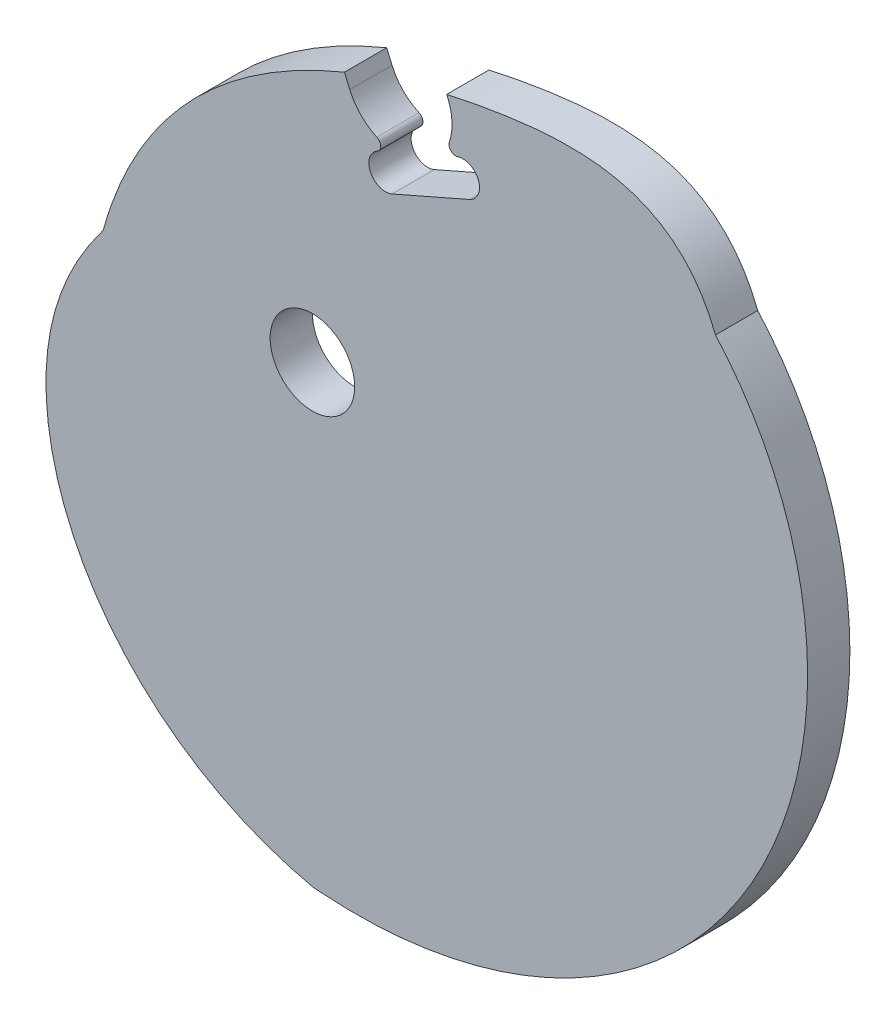
ISO-10303-21;
HEADER;
FILE_DESCRIPTION(('STEP AP214'),'2;1');
FILE_NAME('part.step','',(''),(''),'','','');
FILE_SCHEMA(('AUTOMOTIVE_DESIGN { 1 0 10303 214 1 1 1 1 }'));
ENDSEC;
DATA;
#1=APPLICATION_CONTEXT('core data for automotive mechanical design processes');
#2=APPLICATION_PROTOCOL_DEFINITION('international standard','automotive_design',2000,#1);
#3=PRODUCT_CONTEXT('',#1,'mechanical');
#4=PRODUCT('Part','Part','',(#3));
#5=PRODUCT_RELATED_PRODUCT_CATEGORY('part','',(#4));
#6=PRODUCT_DEFINITION_FORMATION('','',#4);
#7=PRODUCT_DEFINITION_CONTEXT('part definition',#1,'design');
#8=PRODUCT_DEFINITION('design','',#6,#7);
#9=PRODUCT_DEFINITION_SHAPE('','',#8);
#10=(LENGTH_UNIT() NAMED_UNIT(*) SI_UNIT(.MILLI.,.METRE.));
#11=(NAMED_UNIT(*) PLANE_ANGLE_UNIT() SI_UNIT($,.RADIAN.));
#12=(NAMED_UNIT(*) SI_UNIT($,.STERADIAN.) SOLID_ANGLE_UNIT());
#13=UNCERTAINTY_MEASURE_WITH_UNIT(LENGTH_MEASURE(1.E-05),#10,'distance_accuracy_value','');
#14=(GEOMETRIC_REPRESENTATION_CONTEXT(3) GLOBAL_UNCERTAINTY_ASSIGNED_CONTEXT((#13)) GLOBAL_UNIT_ASSIGNED_CONTEXT((#10,
#11,#12)) REPRESENTATION_CONTEXT('',''));
#15=CARTESIAN_POINT('',(0.,0.,0.));
#16=DIRECTION('',(0.,0.,1.));
#17=DIRECTION('',(1.,0.,0.));
#18=AXIS2_PLACEMENT_3D('',#15,#16,#17);
#19=CARTESIAN_POINT('',(60.5619371305853,33.8474695466991,3.175));
#20=CARTESIAN_POINT('',(54.8458013373725,48.4460278109558,3.175));
#21=CARTESIAN_POINT('',(12.8046977852432,48.555602627906,3.175));
#22=CARTESIAN_POINT('',(-23.799499735838,29.1644488940157,3.175));
#23=CARTESIAN_POINT('',(-31.4348540637011,1.47661547140547,3.175));
#24=B_SPLINE_CURVE_WITH_KNOTS('',3,(#19,#20,#21,#22,#23),.UNSPECIFIED.,.F.,.F.,(4,1,4),(0.,
0.323798127449653,1.),.UNSPECIFIED.);
#25=DIRECTION('',(0.,0.,-1.));
#26=VECTOR('',#25,1.);
#27=SURFACE_OF_LINEAR_EXTRUSION('',#24,#26);
#28=CARTESIAN_POINT('',(60.5619371305853,33.8474695466991,-3.175));
#29=CARTESIAN_POINT('',(54.8458013373725,48.4460278109558,-3.175));
#30=CARTESIAN_POINT('',(12.8046977852432,48.555602627906,-3.175));
#31=CARTESIAN_POINT('',(-23.799499735838,29.1644488940157,-3.175));
#32=CARTESIAN_POINT('',(-31.4348540637011,1.47661547140547,-3.175));
#33=B_SPLINE_CURVE_WITH_KNOTS('',3,(#28,#29,#30,#31,#32),.UNSPECIFIED.,.F.,.F.,(4,1,4),(0.,
0.323798127449653,1.),.UNSPECIFIED.);
#34=CARTESIAN_POINT('',(4.81701774321463,40.1667411893854,-3.175));
#35=VERTEX_POINT('',#34);
#36=CARTESIAN_POINT('',(-31.4348540637011,1.47661547140547,-3.175));
#37=VERTEX_POINT('',#36);
#38=EDGE_CURVE('E146',#35,#37,#33,.T.);
#39=ORIENTED_EDGE('',*,*,#38,.T.);
#40=DIRECTION('',(0.,0.,-1.));
#41=VECTOR('',#40,1.);
#42=CARTESIAN_POINT('',(-31.4348540637011,1.47661547140547,3.175));
#43=LINE('',#42,#41);
#44=CARTESIAN_POINT('',(-31.4348540637011,1.47661547140547,3.175));
#45=VERTEX_POINT('',#44);
#46=EDGE_CURVE('E127',#45,#37,#43,.T.);
#47=ORIENTED_EDGE('',*,*,#46,.F.);
#48=CARTESIAN_POINT('',(4.81701774321463,40.1667411893854,3.175));
#49=VERTEX_POINT('',#48);
#50=EDGE_CURVE('E133',#49,#45,#24,.T.);
#51=ORIENTED_EDGE('',*,*,#50,.F.);
#52=DIRECTION('',(0.,0.,-1.));
#53=VECTOR('',#52,1.);
#54=CARTESIAN_POINT('',(4.81701774321463,40.1667411893854,3.175));
#55=LINE('',#54,#53);
#56=EDGE_CURVE('E212',#49,#35,#55,.T.);
#57=ORIENTED_EDGE('',*,*,#56,.T.);
#58=EDGE_LOOP('',(#39,#47,#51,#57));
#59=FACE_BOUND('',#58,.T.);
#60=ADVANCED_FACE('F34',(#59),#27,.F.);
#61=CARTESIAN_POINT('',(-31.4348540637011,1.47661547140547,3.175));
#62=CARTESIAN_POINT('',(-31.5271955050739,1.35385805399761,3.175));
#63=CARTESIAN_POINT('',(-31.7542989654059,1.04973937596788,3.175));
#64=CARTESIAN_POINT('',(-32.1143039997271,0.558316675231956,3.175));
#65=CARTESIAN_POINT('',(-32.5147745004922,-0.00210739070351477,3.175));
#66=CARTESIAN_POINT('',(-32.9142708077019,-0.576495388973752,3.175));
#67=CARTESIAN_POINT('',(-33.3118919239355,-1.1651196793081,3.175));
#68=CARTESIAN_POINT('',(-33.7067252692352,-1.76820669412786,3.175));
#69=CARTESIAN_POINT('',(-34.0978485017142,-2.38593661644943,3.175));
#70=CARTESIAN_POINT('',(-34.4843313459101,-3.01844311672516,3.175));
#71=CARTESIAN_POINT('',(-34.8652374269465,-3.66581314908742,3.175));
#72=CARTESIAN_POINT('',(-35.2396261086108,-4.32808680736756,3.175));
#73=CARTESIAN_POINT('',(-35.6065543334929,-5.00525724116817,3.175));
#74=CARTESIAN_POINT('',(-35.9650784633406,-5.69727063218633,3.175));
#75=CARTESIAN_POINT('',(-36.4331869510712,-6.6447490582035,3.175));
#76=CARTESIAN_POINT('',(-36.877778588292,-7.61622764858573,3.175));
#77=CARTESIAN_POINT('',(-37.4035385485069,-8.8658084867963,3.175));
#78=CARTESIAN_POINT('',(-37.8984464898558,-10.1559634895653,3.175));
#79=CARTESIAN_POINT('',(-38.3396440591053,-11.4784415702963,3.175));
#80=CARTESIAN_POINT('',(-38.6599815356576,-12.5613457183848,3.175));
#81=CARTESIAN_POINT('',(-38.8837421947191,-13.3885999224657,3.175));
#82=CARTESIAN_POINT('',(-39.0892115085197,-14.2270600010824,3.175));
#83=CARTESIAN_POINT('',(-39.2755478800433,-15.0761914975154,3.175));
#84=CARTESIAN_POINT('',(-39.4985527676692,-16.2257151833971,3.175));
#85=CARTESIAN_POINT('',(-39.7269466664858,-17.6867006963235,3.175));
#86=CARTESIAN_POINT('',(-39.9179969877222,-19.4685807410985,3.175));
#87=CARTESIAN_POINT('',(-40.0247824444087,-21.280969712708,3.175));
#88=CARTESIAN_POINT('',(-40.0453414409567,-23.1197424367403,3.175));
#89=CARTESIAN_POINT('',(-39.9779184998096,-24.9806642990756,3.175));
#90=CARTESIAN_POINT('',(-39.8209682969611,-26.859401741563,3.175));
#91=CARTESIAN_POINT('',(-39.5731613386818,-28.7515326089054,3.175));
#92=CARTESIAN_POINT('',(-39.2333886853923,-30.6525568653762,3.175));
#93=CARTESIAN_POINT('',(-38.8007662410798,-32.5579075447291,3.175));
#94=CARTESIAN_POINT('',(-38.2746384873728,-34.4629619307421,3.175));
#95=CARTESIAN_POINT('',(-37.6545816726487,-36.3630529378416,3.175));
#96=CARTESIAN_POINT('',(-36.9404064412537,-38.2534806662588,3.175));
#97=CARTESIAN_POINT('',(-36.1321598945696,-40.1295241045043,3.175));
#98=CARTESIAN_POINT('',(-35.2301270758469,-41.9864529517307,3.175));
#99=CARTESIAN_POINT('',(-34.2348318722511,-43.8195395320881,3.175));
#100=CARTESIAN_POINT('',(-33.1470373288467,-45.6240707728553,3.175));
#101=CARTESIAN_POINT('',(-31.9677453705957,-47.3953602178403,3.175));
#102=CARTESIAN_POINT('',(-30.6981959297948,-49.1287600473285,3.175));
#103=CARTESIAN_POINT('',(-29.3398654777494,-50.8196730756999,3.175));
#104=CARTESIAN_POINT('',(-27.8944649608491,-52.4635646977439,3.175));
#105=CARTESIAN_POINT('',(-26.3639371425927,-54.0559747546705,3.175));
#106=CARTESIAN_POINT('',(-24.7504533544944,-55.5925292908553,3.175));
#107=CARTESIAN_POINT('',(-23.056409660181,-57.0689521724519,3.175));
#108=CARTESIAN_POINT('',(-21.2844224383734,-58.4810765391716,3.175));
#109=CARTESIAN_POINT('',(-19.4373233918151,-59.8248560607632,3.175));
#110=CARTESIAN_POINT('',(-17.5181539905861,-61.0963759700627,3.175));
#111=CARTESIAN_POINT('',(-15.5301593596872,-62.291863845517,3.175));
#112=CARTESIAN_POINT('',(-13.4767816235338,-63.4077001259903,3.175));
#113=CARTESIAN_POINT('',(-11.3616527411705,-64.4404284746504,3.175));
#114=CARTESIAN_POINT('',(-9.5538313128531,-65.2277092886323,3.175));
#115=CARTESIAN_POINT('',(-8.08059767657603,-65.8130602184258,3.175));
#116=CARTESIAN_POINT('',(-6.96083598293377,-66.2300973971278,3.175));
#117=CARTESIAN_POINT('',(-5.82860909868464,-66.6239408336434,3.175));
#118=CARTESIAN_POINT('',(-4.68451739339927,-66.9946921018392,3.175));
#119=CARTESIAN_POINT('',(-3.52885509798768,-67.3403437577619,3.175));
#120=CARTESIAN_POINT('',(-2.36310893323039,-67.6668571150063,3.175));
#121=CARTESIAN_POINT('',(-1.18433789800316,-67.9503791672264,3.175));
#122=CARTESIAN_POINT('',(-0.0140230198654421,-68.2767210036279,3.175));
#123=CARTESIAN_POINT('',(1.19496178019834,-68.3212773071155,3.175));
#124=CARTESIAN_POINT('',(2.38886904696384,-68.4148121777001,3.175));
#125=CARTESIAN_POINT('',(3.58891679820978,-68.4701366795169,3.175));
#126=CARTESIAN_POINT('',(4.79104547148925,-68.5105360967781,3.175));
#127=CARTESIAN_POINT('',(5.99594694138594,-68.5295498057831,3.175));
#128=CARTESIAN_POINT('',(7.20302719869995,-68.5287141454421,3.175));
#129=CARTESIAN_POINT('',(8.41202829209661,-68.5074236556761,3.175));
#130=CARTESIAN_POINT('',(10.4331529775686,-68.4376880562178,3.175));
#131=CARTESIAN_POINT('',(12.8612975444778,-68.2711130352088,3.175));
#132=CARTESIAN_POINT('',(15.6900662790529,-67.9547699935256,3.175));
#133=CARTESIAN_POINT('',(18.1143957080658,-67.5983935418344,3.175));
#134=CARTESIAN_POINT('',(20.5331780678679,-67.1562627393657,3.175));
#135=CARTESIAN_POINT('',(22.9432040297436,-66.6277393839208,3.175));
#136=CARTESIAN_POINT('',(25.3411724897202,-66.0123193791164,3.175));
#137=CARTESIAN_POINT('',(27.7236968095303,-65.309640519207,3.175));
#138=CARTESIAN_POINT('',(30.0873116620169,-64.5194898765923,3.175));
#139=CARTESIAN_POINT('',(32.4284803661157,-63.641810853038,3.175));
#140=CARTESIAN_POINT('',(34.7436027126748,-62.6767098458705,3.175));
#141=CARTESIAN_POINT('',(37.0290232570372,-61.6244625034914,3.175));
#142=CARTESIAN_POINT('',(39.2810400574548,-60.4855195411527,3.175));
#143=CARTESIAN_POINT('',(41.4959138358811,-59.2605120899464,3.175));
#144=CARTESIAN_POINT('',(43.6698775363776,-57.9502565530026,3.175));
#145=CARTESIAN_POINT('',(45.799146254885,-56.5557589442027,3.175));
#146=CARTESIAN_POINT('',(47.8799275127325,-55.0782186860756,3.175));
#147=CARTESIAN_POINT('',(49.9084318449541,-53.5190318449767,3.175));
#148=CARTESIAN_POINT('',(51.8808836732296,-51.8797937831536,3.175));
#149=CARTESIAN_POINT('',(53.7935324321137,-50.1623012088654,3.175));
#150=CARTESIAN_POINT('',(55.6426639161221,-48.3685536073589,3.175));
#151=CARTESIAN_POINT('',(57.4246118142454,-46.5007540371807,3.175));
#152=CARTESIAN_POINT('',(59.1357693975379,-44.5613092780554,3.175));
#153=CARTESIAN_POINT('',(60.7726013245976,-42.5528293183381,3.175));
#154=CARTESIAN_POINT('',(62.3316555290098,-40.4781261718943,3.175));
#155=CARTESIAN_POINT('',(63.8095751521777,-38.3402120161267,3.175));
#156=CARTESIAN_POINT('',(65.203110484405,-36.1422966447878,3.175));
#157=CARTESIAN_POINT('',(66.5091308766348,-33.8877842311542,3.175));
#158=CARTESIAN_POINT('',(67.7246365848887,-31.5802693991165,3.175));
#159=CARTESIAN_POINT('',(68.846770509182,-29.2235326017263,3.175));
#160=CARTESIAN_POINT('',(69.8728297885307,-26.821534808756,3.175));
#161=CARTESIAN_POINT('',(70.8002772136031,-24.378411506854,3.175));
#162=CARTESIAN_POINT('',(71.6267524186069,-21.8984660179033,3.175));
#163=CARTESIAN_POINT('',(72.3500828141476,-19.386162143237,3.175));
#164=CARTESIAN_POINT('',(72.968294223038,-16.8461161433867,3.175));
#165=CARTESIAN_POINT('',(73.4796211813894,-14.2830880650795,3.175));
#166=CARTESIAN_POINT('',(73.8825168677619,-11.7019724292019,3.175));
#167=CARTESIAN_POINT('',(74.1756626237145,-9.10778829545835,3.175));
#168=CARTESIAN_POINT('',(74.3579770297411,-6.50566872142265,3.175));
#169=CARTESIAN_POINT('',(74.4286245013458,-3.90084963563412,3.175));
#170=CARTESIAN_POINT('',(74.3870233708651,-1.29865814630813,3.175));
#171=CARTESIAN_POINT('',(74.2328534216005,1.29549969088462,3.175));
#172=CARTESIAN_POINT('',(73.9660628418845,3.8761516206766,3.175));
#173=CARTESIAN_POINT('',(73.5868745678513,6.43777242460654,3.175));
#174=CARTESIAN_POINT('',(73.0957919849308,8.97479761713109,3.175));
#175=CARTESIAN_POINT('',(72.4936039594229,11.4816375709166,3.175));
#176=CARTESIAN_POINT('',(71.7813891729404,13.9526920391521,3.175));
#177=CARTESIAN_POINT('',(70.9605197340222,16.3823650411574,3.175));
#178=CARTESIAN_POINT('',(70.0326640428275,18.7650800760611,3.175));
#179=CARTESIAN_POINT('',(68.9997888865059,21.0952956279001,3.175));
#180=CARTESIAN_POINT('',(67.8641607446069,23.3675209241399,3.175));
#181=CARTESIAN_POINT('',(66.6283462857423,25.5763319083542,3.175));
#182=CARTESIAN_POINT('',(65.2952120386358,27.716387386622,3.175));
#183=CARTESIAN_POINT('',(63.8679232227305,29.7824453061554,3.175));
#184=CARTESIAN_POINT('',(62.3499417260817,31.769379124269,3.175));
#185=CARTESIAN_POINT('',(61.2240574398106,33.1042441857929,3.175));
#186=CARTESIAN_POINT('',(60.6172255457893,33.7856880769944,3.175));
#187=CARTESIAN_POINT('',(60.5619371305853,33.8474695466991,3.175));
#188=B_SPLINE_CURVE_WITH_KNOTS('',3,(#61,#62,#63,#64,#65,#66,#67,#68,#69,#70,#71,#72,#73,#74,
#75,#76,#77,#78,#79,#80,#81,#82,#83,#84,#85,#86,#87,#88,#89,#90,#91,#92,#93,#94,#95,#96,#97,#98,
#99,#100,#101,#102,#103,#104,#105,#106,#107,#108,#109,#110,#111,#112,#113,#114,#115,#116,#117,
#118,#119,#120,#121,#122,#123,#124,#125,#126,#127,#128,#129,#130,#131,#132,#133,#134,#135,#136,
#137,#138,#139,#140,#141,#142,#143,#144,#145,#146,#147,#148,#149,#150,#151,#152,#153,#154,#155,
#156,#157,#158,#159,#160,#161,#162,#163,#164,#165,#166,#167,#168,#169,#170,#171,#172,#173,#174,
#175,#176,#177,#178,#179,#180,#181,#182,#183,#184,#185,#186,#187),.UNSPECIFIED.,.F.,.F.,(4,1,1,
1,1,1,1,1,1,1,1,1,1,1,1,1,1,1,1,1,1,1,1,1,1,1,1,1,1,1,1,1,1,1,1,1,1,1,1,1,1,1,1,1,1,1,1,1,1,1,1,
1,1,1,1,1,1,1,1,1,1,1,1,1,1,1,1,1,1,1,1,1,1,1,1,1,1,1,1,1,1,1,1,1,1,1,1,1,1,1,1,1,1,1,1,1,1,1,1,
1,1,1,1,1,1,1,1,1,1,1,1,1,1,1,1,1,1,1,1,1,1,1,1,1,4),(0.746012314003824,0.747290583815532,
0.749170775632321,0.751081502142709,0.753022335778869,0.754992805359607,0.756992400864161,
0.759020577712253,0.761076760605168,0.763160346977328,0.765270710102855,0.767407201897033,
0.769569155448383,0.771755887313277,0.776200881879225,0.778457712909329,0.78303639175558,
0.787696808143171,0.790055792039208,0.792432952460962,0.794827531650799,0.797238798561295,
0.79966642633681,0.804570686548355,0.809540165267477,0.814574675490195,0.819673983652232,
0.824837810863722,0.830065834085848,0.83535768725205,0.840712962336512,0.846131210372625,
0.851611942424115,0.857154630511513,0.862758708496548,0.86842357292703,0.874148583844681,
0.879933065558336,0.885776307384806,0.891677564359674,0.897636057920162,0.903650976562152,
0.909721476473387,0.915846682144739,0.922025686961454,0.928257553776111,0.934541315465074,
0.94087597547007,0.947260508326529,0.953693860180259,0.960174949293969,0.966702666545141,
0.973275875916705,0.976579177907748,0.979893414981944,0.983218437788282,0.986554095385043,
0.989900235254681,0.993256703318676,0.996623343952405,1.,1.00331960550908,1.00664483029501,
1.00997571965927,1.0133123145988,1.01665465185375,1.0200027639546,1.02335667926878,
1.02671642204667,1.03683079686155,1.04360311414107,1.05039898365876,1.05721836378183,
1.0640611532037,1.07092719221923,1.07781626396395,1.08472809561903,1.09166235958353,
1.09861867461605,1.10559660694808,1.1125956713715,1.11961533230296,1.12665500482803,
1.13371405572808,1.14079180449333,1.1478875243252,1.15500044313163,1.16212974451902,
1.16927456878458,1.17643401391309,1.1836071365822,1.19079295318056,1.19799044084325,
1.20519853850919,1.21241614800539,1.21964213516314,1.22687533097148,1.23411453277359,
1.2413585055119,1.24860598302836,1.25585566942616,1.26310624050022,1.27035634524359,
1.27760460743779,1.28484962733542,1.29208998344412,1.29932423442135,1.30655092109031,
1.31376856858809,1.32097568865773,1.32817078209697,1.33535234137727,1.34251885344786,
1.34966880274036,1.3568006743911,1.36391295769928,1.37100414984034,1.37807275985579,
1.38511731294157,1.39213635505929,1.39912845789575,1.40609222419798,1.41302629351296,
1.41992934836225,1.42061925189302),.UNSPECIFIED.);
#189=DIRECTION('',(0.,0.,-1.));
#190=VECTOR('',#189,1.);
#191=SURFACE_OF_LINEAR_EXTRUSION('',#188,#190);
#192=CARTESIAN_POINT('',(-31.4348540637011,1.47661547140547,-3.175));
#193=CARTESIAN_POINT('',(-31.5271955050739,1.35385805399761,-3.175));
#194=CARTESIAN_POINT('',(-31.7542989654059,1.04973937596788,-3.175));
#195=CARTESIAN_POINT('',(-32.1143039997271,0.558316675231956,-3.175));
#196=CARTESIAN_POINT('',(-32.5147745004922,-0.00210739070351477,-3.175));
#197=CARTESIAN_POINT('',(-32.9142708077019,-0.576495388973752,-3.175));
#198=CARTESIAN_POINT('',(-33.3118919239355,-1.1651196793081,-3.175));
#199=CARTESIAN_POINT('',(-33.7067252692352,-1.76820669412786,-3.175));
#200=CARTESIAN_POINT('',(-34.0978485017142,-2.38593661644943,-3.175));
#201=CARTESIAN_POINT('',(-34.4843313459101,-3.01844311672516,-3.175));
#202=CARTESIAN_POINT('',(-34.8652374269465,-3.66581314908742,-3.175));
#203=CARTESIAN_POINT('',(-35.2396261086108,-4.32808680736756,-3.175));
#204=CARTESIAN_POINT('',(-35.6065543334929,-5.00525724116817,-3.175));
#205=CARTESIAN_POINT('',(-35.9650784633406,-5.69727063218633,-3.175));
#206=CARTESIAN_POINT('',(-36.4331869510712,-6.6447490582035,-3.175));
#207=CARTESIAN_POINT('',(-36.877778588292,-7.61622764858573,-3.175));
#208=CARTESIAN_POINT('',(-37.4035385485069,-8.8658084867963,-3.175));
#209=CARTESIAN_POINT('',(-37.8984464898558,-10.1559634895653,-3.175));
#210=CARTESIAN_POINT('',(-38.3396440591053,-11.4784415702963,-3.175));
#211=CARTESIAN_POINT('',(-38.6599815356576,-12.5613457183848,-3.175));
#212=CARTESIAN_POINT('',(-38.8837421947191,-13.3885999224657,-3.175));
#213=CARTESIAN_POINT('',(-39.0892115085197,-14.2270600010824,-3.175));
#214=CARTESIAN_POINT('',(-39.2755478800433,-15.0761914975154,-3.175));
#215=CARTESIAN_POINT('',(-39.4985527676692,-16.2257151833971,-3.175));
#216=CARTESIAN_POINT('',(-39.7269466664858,-17.6867006963235,-3.175));
#217=CARTESIAN_POINT('',(-39.9179969877222,-19.4685807410985,-3.175));
#218=CARTESIAN_POINT('',(-40.0247824444087,-21.280969712708,-3.175));
#219=CARTESIAN_POINT('',(-40.0453414409567,-23.1197424367403,-3.175));
#220=CARTESIAN_POINT('',(-39.9779184998096,-24.9806642990756,-3.175));
#221=CARTESIAN_POINT('',(-39.8209682969611,-26.859401741563,-3.175));
#222=CARTESIAN_POINT('',(-39.5731613386818,-28.7515326089054,-3.175));
#223=CARTESIAN_POINT('',(-39.2333886853923,-30.6525568653762,-3.175));
#224=CARTESIAN_POINT('',(-38.8007662410798,-32.5579075447291,-3.175));
#225=CARTESIAN_POINT('',(-38.2746384873728,-34.4629619307421,-3.175));
#226=CARTESIAN_POINT('',(-37.6545816726487,-36.3630529378416,-3.175));
#227=CARTESIAN_POINT('',(-36.9404064412537,-38.2534806662588,-3.175));
#228=CARTESIAN_POINT('',(-36.1321598945696,-40.1295241045043,-3.175));
#229=CARTESIAN_POINT('',(-35.2301270758469,-41.9864529517307,-3.175));
#230=CARTESIAN_POINT('',(-34.2348318722511,-43.8195395320881,-3.175));
#231=CARTESIAN_POINT('',(-33.1470373288467,-45.6240707728553,-3.175));
#232=CARTESIAN_POINT('',(-31.9677453705957,-47.3953602178403,-3.175));
#233=CARTESIAN_POINT('',(-30.6981959297948,-49.1287600473285,-3.175));
#234=CARTESIAN_POINT('',(-29.3398654777494,-50.8196730756999,-3.175));
#235=CARTESIAN_POINT('',(-27.8944649608491,-52.4635646977439,-3.175));
#236=CARTESIAN_POINT('',(-26.3639371425927,-54.0559747546705,-3.175));
#237=CARTESIAN_POINT('',(-24.7504533544944,-55.5925292908553,-3.175));
#238=CARTESIAN_POINT('',(-23.056409660181,-57.0689521724519,-3.175));
#239=CARTESIAN_POINT('',(-21.2844224383734,-58.4810765391716,-3.175));
#240=CARTESIAN_POINT('',(-19.4373233918151,-59.8248560607632,-3.175));
#241=CARTESIAN_POINT('',(-17.5181539905861,-61.0963759700627,-3.175));
#242=CARTESIAN_POINT('',(-15.5301593596872,-62.291863845517,-3.175));
#243=CARTESIAN_POINT('',(-13.4767816235338,-63.4077001259903,-3.175));
#244=CARTESIAN_POINT('',(-11.3616527411705,-64.4404284746504,-3.175));
#245=CARTESIAN_POINT('',(-9.5538313128531,-65.2277092886323,-3.175));
#246=CARTESIAN_POINT('',(-8.08059767657603,-65.8130602184258,-3.175));
#247=CARTESIAN_POINT('',(-6.96083598293377,-66.2300973971278,-3.175));
#248=CARTESIAN_POINT('',(-5.82860909868464,-66.6239408336434,-3.175));
#249=CARTESIAN_POINT('',(-4.68451739339927,-66.9946921018392,-3.175));
#250=CARTESIAN_POINT('',(-3.52885509798768,-67.3403437577619,-3.175));
#251=CARTESIAN_POINT('',(-2.36310893323039,-67.6668571150063,-3.175));
#252=CARTESIAN_POINT('',(-1.18433789800316,-67.9503791672264,-3.175));
#253=CARTESIAN_POINT('',(-0.0140230198654421,-68.2767210036279,-3.175));
#254=CARTESIAN_POINT('',(1.19496178019834,-68.3212773071155,-3.175));
#255=CARTESIAN_POINT('',(2.38886904696384,-68.4148121777001,-3.175));
#256=CARTESIAN_POINT('',(3.58891679820978,-68.4701366795169,-3.175));
#257=CARTESIAN_POINT('',(4.79104547148925,-68.5105360967781,-3.175));
#258=CARTESIAN_POINT('',(5.99594694138594,-68.5295498057831,-3.175));
#259=CARTESIAN_POINT('',(7.20302719869995,-68.5287141454421,-3.175));
#260=CARTESIAN_POINT('',(8.41202829209661,-68.5074236556761,-3.175));
#261=CARTESIAN_POINT('',(10.4331529775686,-68.4376880562178,-3.175));
#262=CARTESIAN_POINT('',(12.8612975444778,-68.2711130352088,-3.175));
#263=CARTESIAN_POINT('',(15.6900662790529,-67.9547699935256,-3.175));
#264=CARTESIAN_POINT('',(18.1143957080658,-67.5983935418344,-3.175));
#265=CARTESIAN_POINT('',(20.5331780678679,-67.1562627393657,-3.175));
#266=CARTESIAN_POINT('',(22.9432040297436,-66.6277393839208,-3.175));
#267=CARTESIAN_POINT('',(25.3411724897202,-66.0123193791164,-3.175));
#268=CARTESIAN_POINT('',(27.7236968095303,-65.309640519207,-3.175));
#269=CARTESIAN_POINT('',(30.0873116620169,-64.5194898765923,-3.175));
#270=CARTESIAN_POINT('',(32.4284803661157,-63.641810853038,-3.175));
#271=CARTESIAN_POINT('',(34.7436027126748,-62.6767098458705,-3.175));
#272=CARTESIAN_POINT('',(37.0290232570372,-61.6244625034914,-3.175));
#273=CARTESIAN_POINT('',(39.2810400574548,-60.4855195411527,-3.175));
#274=CARTESIAN_POINT('',(41.4959138358811,-59.2605120899464,-3.175));
#275=CARTESIAN_POINT('',(43.6698775363776,-57.9502565530026,-3.175));
#276=CARTESIAN_POINT('',(45.799146254885,-56.5557589442027,-3.175));
#277=CARTESIAN_POINT('',(47.8799275127325,-55.0782186860756,-3.175));
#278=CARTESIAN_POINT('',(49.9084318449541,-53.5190318449767,-3.175));
#279=CARTESIAN_POINT('',(51.8808836732296,-51.8797937831536,-3.175));
#280=CARTESIAN_POINT('',(53.7935324321137,-50.1623012088654,-3.175));
#281=CARTESIAN_POINT('',(55.6426639161221,-48.3685536073589,-3.175));
#282=CARTESIAN_POINT('',(57.4246118142454,-46.5007540371807,-3.175));
#283=CARTESIAN_POINT('',(59.1357693975379,-44.5613092780554,-3.175));
#284=CARTESIAN_POINT('',(60.7726013245976,-42.5528293183381,-3.175));
#285=CARTESIAN_POINT('',(62.3316555290098,-40.4781261718943,-3.175));
#286=CARTESIAN_POINT('',(63.8095751521777,-38.3402120161267,-3.175));
#287=CARTESIAN_POINT('',(65.203110484405,-36.1422966447878,-3.175));
#288=CARTESIAN_POINT('',(66.5091308766348,-33.8877842311542,-3.175));
#289=CARTESIAN_POINT('',(67.7246365848887,-31.5802693991165,-3.175));
#290=CARTESIAN_POINT('',(68.846770509182,-29.2235326017263,-3.175));
#291=CARTESIAN_POINT('',(69.8728297885307,-26.821534808756,-3.175));
#292=CARTESIAN_POINT('',(70.8002772136031,-24.378411506854,-3.175));
#293=CARTESIAN_POINT('',(71.6267524186069,-21.8984660179033,-3.175));
#294=CARTESIAN_POINT('',(72.3500828141476,-19.386162143237,-3.175));
#295=CARTESIAN_POINT('',(72.968294223038,-16.8461161433867,-3.175));
#296=CARTESIAN_POINT('',(73.4796211813894,-14.2830880650795,-3.175));
#297=CARTESIAN_POINT('',(73.8825168677619,-11.7019724292019,-3.175));
#298=CARTESIAN_POINT('',(74.1756626237145,-9.10778829545835,-3.175));
#299=CARTESIAN_POINT('',(74.3579770297411,-6.50566872142265,-3.175));
#300=CARTESIAN_POINT('',(74.4286245013458,-3.90084963563412,-3.175));
#301=CARTESIAN_POINT('',(74.3870233708651,-1.29865814630813,-3.175));
#302=CARTESIAN_POINT('',(74.2328534216005,1.29549969088462,-3.175));
#303=CARTESIAN_POINT('',(73.9660628418845,3.8761516206766,-3.175));
#304=CARTESIAN_POINT('',(73.5868745678513,6.43777242460654,-3.175));
#305=CARTESIAN_POINT('',(73.0957919849308,8.97479761713109,-3.175));
#306=CARTESIAN_POINT('',(72.4936039594229,11.4816375709166,-3.175));
#307=CARTESIAN_POINT('',(71.7813891729404,13.9526920391521,-3.175));
#308=CARTESIAN_POINT('',(70.9605197340222,16.3823650411574,-3.175));
#309=CARTESIAN_POINT('',(70.0326640428275,18.7650800760611,-3.175));
#310=CARTESIAN_POINT('',(68.9997888865059,21.0952956279001,-3.175));
#311=CARTESIAN_POINT('',(67.8641607446069,23.3675209241399,-3.175));
#312=CARTESIAN_POINT('',(66.6283462857423,25.5763319083542,-3.175));
#313=CARTESIAN_POINT('',(65.2952120386358,27.716387386622,-3.175));
#314=CARTESIAN_POINT('',(63.8679232227305,29.7824453061554,-3.175));
#315=CARTESIAN_POINT('',(62.3499417260817,31.769379124269,-3.175));
#316=CARTESIAN_POINT('',(61.2240574398106,33.1042441857929,-3.175));
#317=CARTESIAN_POINT('',(60.6172255457893,33.7856880769944,-3.175));
#318=CARTESIAN_POINT('',(60.5619371305853,33.8474695466991,-3.175));
#319=B_SPLINE_CURVE_WITH_KNOTS('',3,(#192,#193,#194,#195,#196,#197,#198,#199,#200,#201,#202,
#203,#204,#205,#206,#207,#208,#209,#210,#211,#212,#213,#214,#215,#216,#217,#218,#219,#220,#221,
#222,#223,#224,#225,#226,#227,#228,#229,#230,#231,#232,#233,#234,#235,#236,#237,#238,#239,#240,
#241,#242,#243,#244,#245,#246,#247,#248,#249,#250,#251,#252,#253,#254,#255,#256,#257,#258,#259,
#260,#261,#262,#263,#264,#265,#266,#267,#268,#269,#270,#271,#272,#273,#274,#275,#276,#277,#278,
#279,#280,#281,#282,#283,#284,#285,#286,#287,#288,#289,#290,#291,#292,#293,#294,#295,#296,#297,
#298,#299,#300,#301,#302,#303,#304,#305,#306,#307,#308,#309,#310,#311,#312,#313,#314,#315,#316,
#317,#318),.UNSPECIFIED.,.F.,.F.,(4,1,1,1,1,1,1,1,1,1,1,1,1,1,1,1,1,1,1,1,1,1,1,1,1,1,1,1,1,1,1,
1,1,1,1,1,1,1,1,1,1,1,1,1,1,1,1,1,1,1,1,1,1,1,1,1,1,1,1,1,1,1,1,1,1,1,1,1,1,1,1,1,1,1,1,1,1,1,1,
1,1,1,1,1,1,1,1,1,1,1,1,1,1,1,1,1,1,1,1,1,1,1,1,1,1,1,1,1,1,1,1,1,1,1,1,1,1,1,1,1,1,1,1,1,4),
(0.746012314003824,0.747290583815532,0.749170775632321,0.751081502142709,0.753022335778869,
0.754992805359607,0.756992400864161,0.759020577712253,0.761076760605168,0.763160346977328,
0.765270710102855,0.767407201897033,0.769569155448383,0.771755887313277,0.776200881879225,
0.778457712909329,0.78303639175558,0.787696808143171,0.790055792039208,0.792432952460962,
0.794827531650799,0.797238798561295,0.79966642633681,0.804570686548355,0.809540165267477,
0.814574675490195,0.819673983652232,0.824837810863722,0.830065834085848,0.83535768725205,
0.840712962336512,0.846131210372625,0.851611942424115,0.857154630511513,0.862758708496548,
0.86842357292703,0.874148583844681,0.879933065558336,0.885776307384806,0.891677564359674,
0.897636057920162,0.903650976562152,0.909721476473387,0.915846682144739,0.922025686961454,
0.928257553776111,0.934541315465074,0.94087597547007,0.947260508326529,0.953693860180259,
0.960174949293969,0.966702666545141,0.973275875916705,0.976579177907748,0.979893414981944,
0.983218437788282,0.986554095385043,0.989900235254681,0.993256703318676,0.996623343952405,1.,
1.00331960550908,1.00664483029501,1.00997571965927,1.0133123145988,1.01665465185375,
1.0200027639546,1.02335667926878,1.02671642204667,1.03683079686155,1.04360311414107,
1.05039898365876,1.05721836378183,1.0640611532037,1.07092719221923,1.07781626396395,
1.08472809561903,1.09166235958353,1.09861867461605,1.10559660694808,1.1125956713715,
1.11961533230296,1.12665500482803,1.13371405572808,1.14079180449333,1.1478875243252,
1.15500044313163,1.16212974451902,1.16927456878458,1.17643401391309,1.1836071365822,
1.19079295318056,1.19799044084325,1.20519853850919,1.21241614800539,1.21964213516314,
1.22687533097148,1.23411453277359,1.2413585055119,1.24860598302836,1.25585566942616,
1.26310624050022,1.27035634524359,1.27760460743779,1.28484962733542,1.29208998344412,
1.29932423442135,1.30655092109031,1.31376856858809,1.32097568865773,1.32817078209697,
1.33535234137727,1.34251885344786,1.34966880274036,1.3568006743911,1.36391295769928,
1.37100414984034,1.37807275985579,1.38511731294157,1.39213635505929,1.39912845789575,
1.40609222419798,1.41302629351296,1.41992934836225,1.42061925189302),.UNSPECIFIED.);
#320=CARTESIAN_POINT('',(60.5619371305853,33.8474695466991,-3.175));
#321=VERTEX_POINT('',#320);
#322=EDGE_CURVE('E194',#37,#321,#319,.T.);
#323=ORIENTED_EDGE('',*,*,#322,.T.);
#324=DIRECTION('',(0.,0.,-1.));
#325=VECTOR('',#324,1.);
#326=CARTESIAN_POINT('',(60.5619371305853,33.8474695466991,3.175));
#327=LINE('',#326,#325);
#328=CARTESIAN_POINT('',(60.5619371305853,33.8474695466991,3.175));
#329=VERTEX_POINT('',#328);
#330=EDGE_CURVE('E130',#329,#321,#327,.T.);
#331=ORIENTED_EDGE('',*,*,#330,.F.);
#332=EDGE_CURVE('E123',#45,#329,#188,.T.);
#333=ORIENTED_EDGE('',*,*,#332,.F.);
#334=ORIENTED_EDGE('',*,*,#46,.T.);
#335=EDGE_LOOP('',(#323,#331,#333,#334));
#336=FACE_BOUND('',#335,.T.);
#337=ADVANCED_FACE('F125',(#336),#191,.F.);
#338=CARTESIAN_POINT('',(20.1797166636021,44.9568203076459,-3.175));
#339=VERTEX_POINT('',#338);
#340=EDGE_CURVE('E190',#321,#339,#33,.T.);
#341=ORIENTED_EDGE('',*,*,#340,.T.);
#342=DIRECTION('',(0.,0.,-1.));
#343=VECTOR('',#342,1.);
#344=CARTESIAN_POINT('',(20.1797166636021,44.9568203076459,3.175));
#345=LINE('',#344,#343);
#346=CARTESIAN_POINT('',(20.1797166636021,44.9568203076459,3.175));
#347=VERTEX_POINT('',#346);
#348=EDGE_CURVE('E152',#347,#339,#345,.T.);
#349=ORIENTED_EDGE('',*,*,#348,.F.);
#350=EDGE_CURVE('E132',#329,#347,#24,.T.);
#351=ORIENTED_EDGE('',*,*,#350,.F.);
#352=ORIENTED_EDGE('',*,*,#330,.T.);
#353=EDGE_LOOP('',(#341,#349,#351,#352));
#354=FACE_BOUND('',#353,.T.);
#355=ADVANCED_FACE('F239',(#354),#27,.F.);
#356=CARTESIAN_POINT('',(33.2971402554925,14.2015611209112,3.175));
#357=DIRECTION('',(-0.919830197893243,-0.39231671777236,0.));
#358=DIRECTION('',(0.39231671777236,-0.919830197893243,0.));
#359=AXIS2_PLACEMENT_3D('',#356,#357,#358);
#360=PLANE('',#359);
#361=DIRECTION('',(-0.39231671777236,0.919830197893243,0.));
#362=VECTOR('',#361,1.);
#363=CARTESIAN_POINT('',(33.2971402554925,14.2015611209112,-3.175));
#364=LINE('',#363,#362);
#365=CARTESIAN_POINT('',(20.3419618611836,44.5764183888951,-3.175));
#366=VERTEX_POINT('',#365);
#367=EDGE_CURVE('E186',#366,#339,#364,.T.);
#368=ORIENTED_EDGE('',*,*,#367,.F.);
#369=DIRECTION('',(0.,0.,-1.));
#370=VECTOR('',#369,1.);
#371=CARTESIAN_POINT('',(20.3419618611836,44.5764183888951,3.175));
#372=LINE('',#371,#370);
#373=CARTESIAN_POINT('',(20.3419618611836,44.5764183888951,3.175));
#374=VERTEX_POINT('',#373);
#375=EDGE_CURVE('E269',#374,#366,#372,.T.);
#376=ORIENTED_EDGE('',*,*,#375,.F.);
#377=DIRECTION('',(-0.39231671777236,0.919830197893243,0.));
#378=VECTOR('',#377,1.);
#379=CARTESIAN_POINT('',(33.2971402554925,14.2015611209112,3.175));
#380=LINE('',#379,#378);
#381=EDGE_CURVE('E223',#374,#347,#380,.T.);
#382=ORIENTED_EDGE('',*,*,#381,.T.);
#383=ORIENTED_EDGE('',*,*,#348,.T.);
#384=EDGE_LOOP('',(#368,#376,#382,#383));
#385=FACE_BOUND('',#384,.T.);
#386=ADVANCED_FACE('F259',(#385),#360,.T.);
#387=CARTESIAN_POINT('',(12.9785820033916,41.4358637255054,3.175));
#388=DIRECTION('',(0.,0.,-1.));
#389=DIRECTION('',(-1.,0.,0.));
#390=AXIS2_PLACEMENT_3D('',#387,#388,#389);
#391=CYLINDRICAL_SURFACE('',#390,8.00515124928165);
#392=CARTESIAN_POINT('',(12.9785820033916,41.4358637255054,-3.175));
#393=DIRECTION('',(0.,0.,1.));
#394=DIRECTION('',(1.,0.,0.));
#395=AXIS2_PLACEMENT_3D('',#392,#393,#394);
#396=CIRCLE('',#395,8.00515124928165);
#397=CARTESIAN_POINT('',(20.5814463711168,38.9300904057794,-3.175));
#398=VERTEX_POINT('',#397);
#399=EDGE_CURVE('E179',#398,#366,#396,.T.);
#400=ORIENTED_EDGE('',*,*,#399,.F.);
#401=DIRECTION('',(0.,0.,-1.));
#402=VECTOR('',#401,1.);
#403=CARTESIAN_POINT('',(20.5814463711168,38.9300904057794,3.175));
#404=LINE('',#403,#402);
#405=CARTESIAN_POINT('',(20.5814463711168,38.9300904057794,3.175));
#406=VERTEX_POINT('',#405);
#407=EDGE_CURVE('E159',#398,#406,#404,.F.);
#408=ORIENTED_EDGE('',*,*,#407,.T.);
#409=CARTESIAN_POINT('',(12.9785820033916,41.4358637255054,3.175));
#410=DIRECTION('',(0.,0.,1.));
#411=DIRECTION('',(1.,0.,0.));
#412=AXIS2_PLACEMENT_3D('',#409,#410,#411);
#413=CIRCLE('',#412,8.00515124928165);
#414=EDGE_CURVE('E221',#406,#374,#413,.T.);
#415=ORIENTED_EDGE('',*,*,#414,.T.);
#416=ORIENTED_EDGE('',*,*,#375,.T.);
#417=EDGE_LOOP('',(#400,#408,#415,#416));
#418=FACE_BOUND('',#417,.T.);
#419=ADVANCED_FACE('F264',(#418),#391,.F.);
#420=CARTESIAN_POINT('',(22.6103703450504,35.2875994711417,3.175));
#421=DIRECTION('',(0.,0.,-1.));
#422=DIRECTION('',(-1.,0.,0.));
#423=AXIS2_PLACEMENT_3D('',#420,#421,#422);
#424=CYLINDRICAL_SURFACE('',#423,2.50000000000001);
#425=CARTESIAN_POINT('',(22.6103703450504,35.2875994711417,3.175));
#426=DIRECTION('',(0.,0.,1.));
#427=DIRECTION('',(1.,0.,0.));
#428=AXIS2_PLACEMENT_3D('',#425,#426,#427);
#429=CIRCLE('',#428,2.50000000000001);
#430=CARTESIAN_POINT('',(23.6148029635296,32.9982512855362,3.175));
#431=VERTEX_POINT('',#430);
#432=CARTESIAN_POINT('',(21.8395292910583,37.6657929177479,3.175));
#433=VERTEX_POINT('',#432);
#434=EDGE_CURVE('E218',#431,#433,#429,.T.);
#435=ORIENTED_EDGE('',*,*,#434,.T.);
#436=DIRECTION('',(0.,0.,-1.));
#437=VECTOR('',#436,1.);
#438=CARTESIAN_POINT('',(21.8395292910583,37.6657929177479,3.175));
#439=LINE('',#438,#437);
#440=CARTESIAN_POINT('',(21.8395292910583,37.6657929177479,-3.175));
#441=VERTEX_POINT('',#440);
#442=EDGE_CURVE('E147',#433,#441,#439,.T.);
#443=ORIENTED_EDGE('',*,*,#442,.T.);
#444=CARTESIAN_POINT('',(22.6103703450504,35.2875994711417,-3.175));
#445=DIRECTION('',(0.,0.,1.));
#446=DIRECTION('',(1.,0.,0.));
#447=AXIS2_PLACEMENT_3D('',#444,#445,#446);
#448=CIRCLE('',#447,2.50000000000001);
#449=CARTESIAN_POINT('',(23.6148029635296,32.9982512855362,-3.175));
#450=VERTEX_POINT('',#449);
#451=EDGE_CURVE('E185',#450,#441,#448,.T.);
#452=ORIENTED_EDGE('',*,*,#451,.F.);
#453=DIRECTION('',(0.,0.,-1.));
#454=VECTOR('',#453,1.);
#455=CARTESIAN_POINT('',(23.6148029635296,32.9982512855362,3.175));
#456=LINE('',#455,#454);
#457=EDGE_CURVE('E271',#431,#450,#456,.T.);
#458=ORIENTED_EDGE('',*,*,#457,.F.);
#459=EDGE_LOOP('',(#435,#443,#452,#458));
#460=FACE_BOUND('',#459,.T.);
#461=ADVANCED_FACE('F290',(#460),#424,.F.);
#462=CARTESIAN_POINT('',(-8.32875661164626,18.9832782074442,3.175));
#463=DIRECTION('',(-0.401773047391671,0.915739274242188,0.));
#464=DIRECTION('',(-0.915739274242188,-0.401773047391672,0.));
#465=AXIS2_PLACEMENT_3D('',#462,#463,#464);
#466=PLANE('',#465);
#467=DIRECTION('',(0.915739274242188,0.401773047391672,0.));
#468=VECTOR('',#467,1.);
#469=CARTESIAN_POINT('',(-8.32875661164626,18.9832782074442,-3.175));
#470=LINE('',#469,#468);
#471=CARTESIAN_POINT('',(11.9849141806538,27.895733583662,-3.175));
#472=VERTEX_POINT('',#471);
#473=EDGE_CURVE('E181',#472,#450,#470,.T.);
#474=ORIENTED_EDGE('',*,*,#473,.F.);
#475=DIRECTION('',(0.,0.,-1.));
#476=VECTOR('',#475,1.);
#477=CARTESIAN_POINT('',(11.9849141806538,27.895733583662,3.175));
#478=LINE('',#477,#476);
#479=CARTESIAN_POINT('',(11.9849141806538,27.895733583662,3.175));
#480=VERTEX_POINT('',#479);
#481=EDGE_CURVE('E273',#480,#472,#478,.T.);
#482=ORIENTED_EDGE('',*,*,#481,.F.);
#483=DIRECTION('',(0.915739274242188,0.401773047391672,0.));
#484=VECTOR('',#483,1.);
#485=CARTESIAN_POINT('',(-8.32875661164626,18.9832782074442,3.175));
#486=LINE('',#485,#484);
#487=EDGE_CURVE('E215',#480,#431,#486,.T.);
#488=ORIENTED_EDGE('',*,*,#487,.T.);
#489=ORIENTED_EDGE('',*,*,#457,.T.);
#490=EDGE_LOOP('',(#474,#482,#488,#489));
#491=FACE_BOUND('',#490,.T.);
#492=ADVANCED_FACE('F286',(#491),#466,.T.);
#493=CARTESIAN_POINT('',(10.9804815621746,30.1850817692675,3.175));
#494=DIRECTION('',(0.,0.,-1.));
#495=DIRECTION('',(-1.,0.,0.));
#496=AXIS2_PLACEMENT_3D('',#493,#494,#495);
#497=CYLINDRICAL_SURFACE('',#496,2.5);
#498=CARTESIAN_POINT('',(10.9804815621746,30.1850817692675,-3.175));
#499=DIRECTION('',(0.,0.,1.));
#500=DIRECTION('',(1.,0.,0.));
#501=AXIS2_PLACEMENT_3D('',#498,#499,#500);
#502=CIRCLE('',#501,2.5);
#503=CARTESIAN_POINT('',(9.75249503586438,32.3627064135073,-3.175));
#504=VERTEX_POINT('',#503);
#505=EDGE_CURVE('E177',#504,#472,#502,.T.);
#506=ORIENTED_EDGE('',*,*,#505,.F.);
#507=DIRECTION('',(0.,0.,-1.));
#508=VECTOR('',#507,1.);
#509=CARTESIAN_POINT('',(9.75249503586438,32.3627064135073,3.175));
#510=LINE('',#509,#508);
#511=CARTESIAN_POINT('',(9.75249503586438,32.3627064135073,3.175));
#512=VERTEX_POINT('',#511);
#513=EDGE_CURVE('E11',#504,#512,#510,.F.);
#514=ORIENTED_EDGE('',*,*,#513,.T.);
#515=CARTESIAN_POINT('',(10.9804815621746,30.1850817692675,3.175));
#516=DIRECTION('',(0.,0.,1.));
#517=DIRECTION('',(1.,0.,0.));
#518=AXIS2_PLACEMENT_3D('',#515,#516,#517);
#519=CIRCLE('',#518,2.5);
#520=EDGE_CURVE('E213',#512,#480,#519,.T.);
#521=ORIENTED_EDGE('',*,*,#520,.T.);
#522=ORIENTED_EDGE('',*,*,#481,.T.);
#523=EDGE_LOOP('',(#506,#514,#521,#522));
#524=FACE_BOUND('',#523,.T.);
#525=ADVANCED_FACE('F302',(#524),#497,.F.);
#526=CARTESIAN_POINT('',(5.61520215655452,38.2953090364308,3.175));
#527=VERTEX_POINT('',#526);
#528=CARTESIAN_POINT('',(9.67409544400785,34.1445802237667,3.175));
#529=VERTEX_POINT('',#528);
#530=EDGE_CURVE('E170',#527,#529,#413,.T.);
#531=ORIENTED_EDGE('',*,*,#530,.T.);
#532=DIRECTION('',(0.,0.,-1.));
#533=VECTOR('',#532,1.);
#534=CARTESIAN_POINT('',(9.67409544400785,34.1445802237667,3.175));
#535=LINE('',#534,#533);
#536=CARTESIAN_POINT('',(9.67409544400785,34.1445802237667,-3.175));
#537=VERTEX_POINT('',#536);
#538=EDGE_CURVE('E42',#529,#537,#535,.T.);
#539=ORIENTED_EDGE('',*,*,#538,.T.);
#540=CARTESIAN_POINT('',(5.61520215655452,38.2953090364308,-3.175));
#541=VERTEX_POINT('',#540);
#542=EDGE_CURVE('E169',#541,#537,#396,.T.);
#543=ORIENTED_EDGE('',*,*,#542,.F.);
#544=DIRECTION('',(0.,0.,-1.));
#545=VECTOR('',#544,1.);
#546=CARTESIAN_POINT('',(5.61520215655452,38.2953090364308,3.175));
#547=LINE('',#546,#545);
#548=EDGE_CURVE('E278',#527,#541,#547,.T.);
#549=ORIENTED_EDGE('',*,*,#548,.F.);
#550=EDGE_LOOP('',(#531,#539,#543,#549));
#551=FACE_BOUND('',#550,.T.);
#552=ADVANCED_FACE('F168',(#551),#391,.F.);
#553=CARTESIAN_POINT('',(0.,0.,3.175));
#554=DIRECTION('',(0.,0.,-1.));
#555=DIRECTION('',(-1.,0.,0.));
#556=AXIS2_PLACEMENT_3D('',#553,#554,#555);
#557=CYLINDRICAL_SURFACE('',#556,6.35);
#558=CARTESIAN_POINT('',(0.,0.,3.175));
#559=DIRECTION('',(0.,0.,1.));
#560=DIRECTION('',(1.,0.,0.));
#561=AXIS2_PLACEMENT_3D('',#558,#559,#560);
#562=CIRCLE('',#561,6.35);
#563=CARTESIAN_POINT('',(6.35,0.,3.175));
#564=VERTEX_POINT('',#563);
#565=EDGE_CURVE('E143',#564,#564,#562,.T.);
#566=ORIENTED_EDGE('',*,*,#565,.T.);
#567=EDGE_LOOP('',(#566));
#568=FACE_BOUND('',#567,.T.);
#569=CARTESIAN_POINT('',(0.,0.,-3.175));
#570=DIRECTION('',(0.,0.,1.));
#571=DIRECTION('',(1.,0.,0.));
#572=AXIS2_PLACEMENT_3D('',#569,#570,#571);
#573=CIRCLE('',#572,6.35);
#574=CARTESIAN_POINT('',(6.35,0.,-3.175));
#575=VERTEX_POINT('',#574);
#576=EDGE_CURVE('E205',#575,#575,#573,.T.);
#577=ORIENTED_EDGE('',*,*,#576,.F.);
#578=EDGE_LOOP('',(#577));
#579=FACE_BOUND('',#578,.T.);
#580=ADVANCED_FACE('F241',(#568,#579),#557,.F.);
#581=CARTESIAN_POINT('',(18.5703806182344,7.92045190410057,3.175));
#582=DIRECTION('',(-0.919830196524753,-0.392316720980938,0.));
#583=DIRECTION('',(0.392316720980938,-0.919830196524753,0.));
#584=AXIS2_PLACEMENT_3D('',#581,#582,#583);
#585=PLANE('',#584);
#586=DIRECTION('',(-0.392316720980938,0.919830196524753,0.));
#587=VECTOR('',#586,1.);
#588=CARTESIAN_POINT('',(18.5703806182344,7.92045190410057,-3.175));
#589=LINE('',#588,#587);
#590=EDGE_CURVE('E176',#541,#35,#589,.T.);
#591=ORIENTED_EDGE('',*,*,#590,.T.);
#592=ORIENTED_EDGE('',*,*,#56,.F.);
#593=DIRECTION('',(-0.392316720980938,0.919830196524753,0.));
#594=VECTOR('',#593,1.);
#595=CARTESIAN_POINT('',(18.5703806182344,7.92045190410057,3.175));
#596=LINE('',#595,#594);
#597=EDGE_CURVE('E139',#527,#49,#596,.T.);
#598=ORIENTED_EDGE('',*,*,#597,.F.);
#599=ORIENTED_EDGE('',*,*,#548,.T.);
#600=EDGE_LOOP('',(#591,#592,#598,#599));
#601=FACE_BOUND('',#600,.T.);
#602=ADVANCED_FACE('F243',(#601),#585,.F.);
#603=CARTESIAN_POINT('',(0.,0.,3.175));
#604=DIRECTION('',(0.,0.,1.));
#605=DIRECTION('',(1.,0.,0.));
#606=AXIS2_PLACEMENT_3D('',#603,#604,#605);
#607=PLANE('',#606);
#608=ORIENTED_EDGE('',*,*,#565,.F.);
#609=EDGE_LOOP('',(#608));
#610=FACE_BOUND('',#609,.T.);
#611=ORIENTED_EDGE('',*,*,#414,.F.);
#612=CARTESIAN_POINT('',(21.5311928694615,38.6170702963903,3.175));
#613=DIRECTION('',(0.,0.,1.));
#614=DIRECTION('',(1.,0.,0.));
#615=AXIS2_PLACEMENT_3D('',#612,#613,#614);
#616=CIRCLE('',#615,1.);
#617=EDGE_CURVE('E162',#406,#433,#616,.T.);
#618=ORIENTED_EDGE('',*,*,#617,.T.);
#619=ORIENTED_EDGE('',*,*,#434,.F.);
#620=ORIENTED_EDGE('',*,*,#487,.F.);
#621=ORIENTED_EDGE('',*,*,#520,.F.);
#622=CARTESIAN_POINT('',(9.2613004253403,33.2337562712032,3.175));
#623=DIRECTION('',(0.,0.,1.));
#624=DIRECTION('',(1.,0.,0.));
#625=AXIS2_PLACEMENT_3D('',#622,#623,#624);
#626=CIRCLE('',#625,1.);
#627=EDGE_CURVE('E49',#512,#529,#626,.T.);
#628=ORIENTED_EDGE('',*,*,#627,.T.);
#629=ORIENTED_EDGE('',*,*,#530,.F.);
#630=ORIENTED_EDGE('',*,*,#597,.T.);
#631=ORIENTED_EDGE('',*,*,#50,.T.);
#632=ORIENTED_EDGE('',*,*,#332,.T.);
#633=ORIENTED_EDGE('',*,*,#350,.T.);
#634=ORIENTED_EDGE('',*,*,#381,.F.);
#635=EDGE_LOOP('',(#611,#618,#619,#620,#621,#628,#629,#630,#631,#632,#633,#634));
#636=FACE_BOUND('',#635,.T.);
#637=ADVANCED_FACE('F137',(#610,#636),#607,.T.);
#638=CARTESIAN_POINT('',(0.,0.,-3.175));
#639=DIRECTION('',(0.,0.,1.));
#640=DIRECTION('',(1.,0.,0.));
#641=AXIS2_PLACEMENT_3D('',#638,#639,#640);
#642=PLANE('',#641);
#643=ORIENTED_EDGE('',*,*,#576,.T.);
#644=EDGE_LOOP('',(#643));
#645=FACE_BOUND('',#644,.T.);
#646=ORIENTED_EDGE('',*,*,#451,.T.);
#647=CARTESIAN_POINT('',(21.5311928694615,38.6170702963903,-3.175));
#648=DIRECTION('',(0.,0.,1.));
#649=DIRECTION('',(1.,0.,0.));
#650=AXIS2_PLACEMENT_3D('',#647,#648,#649);
#651=CIRCLE('',#650,1.);
#652=EDGE_CURVE('E157',#441,#398,#651,.F.);
#653=ORIENTED_EDGE('',*,*,#652,.T.);
#654=ORIENTED_EDGE('',*,*,#399,.T.);
#655=ORIENTED_EDGE('',*,*,#367,.T.);
#656=ORIENTED_EDGE('',*,*,#340,.F.);
#657=ORIENTED_EDGE('',*,*,#322,.F.);
#658=ORIENTED_EDGE('',*,*,#38,.F.);
#659=ORIENTED_EDGE('',*,*,#590,.F.);
#660=ORIENTED_EDGE('',*,*,#542,.T.);
#661=CARTESIAN_POINT('',(9.2613004253403,33.2337562712032,-3.175));
#662=DIRECTION('',(0.,0.,1.));
#663=DIRECTION('',(1.,0.,0.));
#664=AXIS2_PLACEMENT_3D('',#661,#662,#663);
#665=CIRCLE('',#664,1.);
#666=EDGE_CURVE('E150',#537,#504,#665,.F.);
#667=ORIENTED_EDGE('',*,*,#666,.T.);
#668=ORIENTED_EDGE('',*,*,#505,.T.);
#669=ORIENTED_EDGE('',*,*,#473,.T.);
#670=EDGE_LOOP('',(#646,#653,#654,#655,#656,#657,#658,#659,#660,#667,#668,#669));
#671=FACE_BOUND('',#670,.T.);
#672=ADVANCED_FACE('F175',(#645,#671),#642,.F.);
#673=CARTESIAN_POINT('',(21.5311928694615,38.6170702963903,3.175));
#674=DIRECTION('',(0.,0.,-1.));
#675=DIRECTION('',(-1.,0.,0.));
#676=AXIS2_PLACEMENT_3D('',#673,#674,#675);
#677=CYLINDRICAL_SURFACE('',#676,1.);
#678=ORIENTED_EDGE('',*,*,#617,.F.);
#679=ORIENTED_EDGE('',*,*,#407,.F.);
#680=ORIENTED_EDGE('',*,*,#652,.F.);
#681=ORIENTED_EDGE('',*,*,#442,.F.);
#682=EDGE_LOOP('',(#678,#679,#680,#681));
#683=FACE_BOUND('',#682,.T.);
#684=ADVANCED_FACE('F245',(#683),#677,.T.);
#685=CARTESIAN_POINT('',(9.2613004253403,33.2337562712032,3.175));
#686=DIRECTION('',(0.,0.,-1.));
#687=DIRECTION('',(-1.,0.,0.));
#688=AXIS2_PLACEMENT_3D('',#685,#686,#687);
#689=CYLINDRICAL_SURFACE('',#688,1.);
#690=ORIENTED_EDGE('',*,*,#627,.F.);
#691=ORIENTED_EDGE('',*,*,#513,.F.);
#692=ORIENTED_EDGE('',*,*,#666,.F.);
#693=ORIENTED_EDGE('',*,*,#538,.F.);
#694=EDGE_LOOP('',(#690,#691,#692,#693));
#695=FACE_BOUND('',#694,.T.);
#696=ADVANCED_FACE('F36',(#695),#689,.T.);
#697=CLOSED_SHELL('',(#60,#337,#355,#386,#419,#461,#492,#525,#552,#580,#602,#637,#672,#684,#696));
#698=MANIFOLD_SOLID_BREP('B2',#697);
#699=ADVANCED_BREP_SHAPE_REPRESENTATION('',(#18,#698),#14);
#700=SHAPE_DEFINITION_REPRESENTATION(#9,#699);
ENDSEC;
END-ISO-10303-21;
